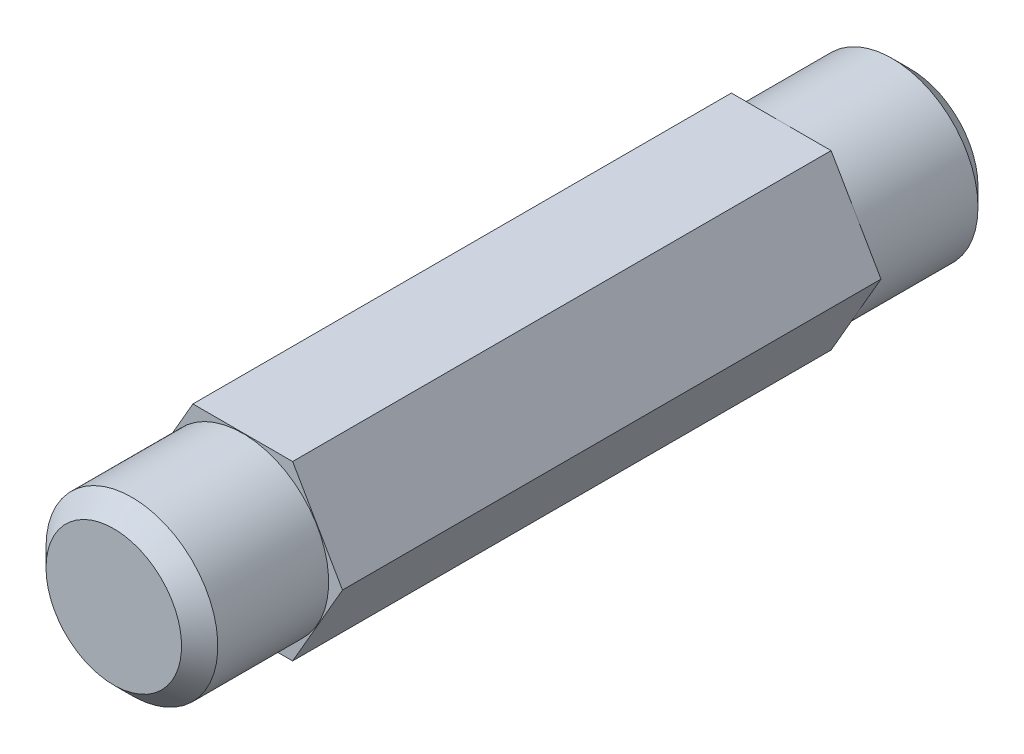
ISO-10303-21;
HEADER;
FILE_DESCRIPTION(('STEP AP214'),'2;1');
FILE_NAME('part.step','',(''),(''),'','','');
FILE_SCHEMA(('AUTOMOTIVE_DESIGN { 1 0 10303 214 1 1 1 1 }'));
ENDSEC;
DATA;
#1=APPLICATION_CONTEXT('core data for automotive mechanical design processes');
#2=APPLICATION_PROTOCOL_DEFINITION('international standard','automotive_design',2000,#1);
#3=PRODUCT_CONTEXT('',#1,'mechanical');
#4=PRODUCT('Part','Part','',(#3));
#5=PRODUCT_RELATED_PRODUCT_CATEGORY('part','',(#4));
#6=PRODUCT_DEFINITION_FORMATION('','',#4);
#7=PRODUCT_DEFINITION_CONTEXT('part definition',#1,'design');
#8=PRODUCT_DEFINITION('design','',#6,#7);
#9=PRODUCT_DEFINITION_SHAPE('','',#8);
#10=(LENGTH_UNIT() NAMED_UNIT(*) SI_UNIT(.MILLI.,.METRE.));
#11=(NAMED_UNIT(*) PLANE_ANGLE_UNIT() SI_UNIT($,.RADIAN.));
#12=(NAMED_UNIT(*) SI_UNIT($,.STERADIAN.) SOLID_ANGLE_UNIT());
#13=UNCERTAINTY_MEASURE_WITH_UNIT(LENGTH_MEASURE(1.E-05),#10,'distance_accuracy_value','');
#14=(GEOMETRIC_REPRESENTATION_CONTEXT(3) GLOBAL_UNCERTAINTY_ASSIGNED_CONTEXT((#13)) GLOBAL_UNIT_ASSIGNED_CONTEXT((#10,
#11,#12)) REPRESENTATION_CONTEXT('',''));
#15=CARTESIAN_POINT('',(0.,0.,0.));
#16=DIRECTION('',(0.,0.,1.));
#17=DIRECTION('',(1.,0.,0.));
#18=AXIS2_PLACEMENT_3D('',#15,#16,#17);
#19=CARTESIAN_POINT('',(0.,0.,21.9583));
#20=DIRECTION('',(0.,0.,1.));
#21=DIRECTION('',(1.,0.,0.));
#22=AXIS2_PLACEMENT_3D('',#19,#20,#21);
#23=PLANE('',#22);
#24=CARTESIAN_POINT('',(0.,0.,21.9582999999943));
#25=DIRECTION('',(0.,0.,-1.));
#26=DIRECTION('',(-1.,0.,0.));
#27=AXIS2_PLACEMENT_3D('',#24,#25,#26);
#28=CIRCLE('',#27,3.73710000002347);
#29=CARTESIAN_POINT('',(-3.73710000002347,0.,21.9582999999943));
#30=VERTEX_POINT('',#29);
#31=EDGE_CURVE('E20',#30,#30,#28,.T.);
#32=ORIENTED_EDGE('',*,*,#31,.F.);
#33=EDGE_LOOP('',(#32));
#34=FACE_BOUND('',#33,.T.);
#35=ADVANCED_FACE('F17',(#34),#23,.T.);
#36=CARTESIAN_POINT('',(0.,0.,-21.9583));
#37=DIRECTION('',(0.,0.,-1.));
#38=DIRECTION('',(-1.,0.,0.));
#39=AXIS2_PLACEMENT_3D('',#36,#37,#38);
#40=PLANE('',#39);
#41=CARTESIAN_POINT('',(0.,0.,-21.9583000000512));
#42=DIRECTION('',(0.,0.,1.));
#43=DIRECTION('',(1.,0.,0.));
#44=AXIS2_PLACEMENT_3D('',#41,#42,#43);
#45=CIRCLE('',#44,3.73709999996663);
#46=CARTESIAN_POINT('',(3.73709999996663,0.,-21.9583000000512));
#47=VERTEX_POINT('',#46);
#48=EDGE_CURVE('E106',#47,#47,#45,.T.);
#49=ORIENTED_EDGE('',*,*,#48,.F.);
#50=EDGE_LOOP('',(#49));
#51=FACE_BOUND('',#50,.T.);
#52=ADVANCED_FACE('F124',(#51),#40,.T.);
#53=CARTESIAN_POINT('',(0.,0.,20.9582999999043));
#54=DIRECTION('',(0.,0.,-1.));
#55=DIRECTION('',(-1.,0.,0.));
#56=AXIS2_PLACEMENT_3D('',#53,#54,#55);
#57=CONICAL_SURFACE('',#56,4.73710000011351,0.785398163397448);
#58=CARTESIAN_POINT('',(0.,0.,20.9583));
#59=DIRECTION('',(0.,0.,-1.));
#60=DIRECTION('',(-1.,0.,0.));
#61=AXIS2_PLACEMENT_3D('',#58,#59,#60);
#62=CIRCLE('',#61,4.7371);
#63=CARTESIAN_POINT('',(-4.7371,0.,20.9583));
#64=VERTEX_POINT('',#63);
#65=EDGE_CURVE('E103',#64,#64,#62,.T.);
#66=ORIENTED_EDGE('',*,*,#65,.F.);
#67=EDGE_LOOP('',(#66));
#68=FACE_BOUND('',#67,.T.);
#69=ORIENTED_EDGE('',*,*,#31,.T.);
#70=EDGE_LOOP('',(#69));
#71=FACE_BOUND('',#70,.T.);
#72=ADVANCED_FACE('F121',(#68,#71),#57,.T.);
#73=CARTESIAN_POINT('',(0.,0.,-20.958300000018));
#74=DIRECTION('',(0.,0.,1.));
#75=DIRECTION('',(1.,0.,0.));
#76=AXIS2_PLACEMENT_3D('',#73,#74,#75);
#77=CONICAL_SURFACE('',#76,4.73709999994298,0.785398163369027);
#78=CARTESIAN_POINT('',(0.,0.,-20.9583));
#79=DIRECTION('',(0.,0.,1.));
#80=DIRECTION('',(1.,0.,0.));
#81=AXIS2_PLACEMENT_3D('',#78,#79,#80);
#82=CIRCLE('',#81,4.7371);
#83=CARTESIAN_POINT('',(4.7371,0.,-20.9583));
#84=VERTEX_POINT('',#83);
#85=EDGE_CURVE('E100',#84,#84,#82,.T.);
#86=ORIENTED_EDGE('',*,*,#85,.F.);
#87=EDGE_LOOP('',(#86));
#88=FACE_BOUND('',#87,.T.);
#89=ORIENTED_EDGE('',*,*,#48,.T.);
#90=EDGE_LOOP('',(#89));
#91=FACE_BOUND('',#90,.T.);
#92=ADVANCED_FACE('F166',(#88,#91),#77,.T.);
#93=CARTESIAN_POINT('',(0.,0.,21.9583));
#94=DIRECTION('',(0.,0.,-1.));
#95=DIRECTION('',(-1.,0.,0.));
#96=AXIS2_PLACEMENT_3D('',#93,#94,#95);
#97=CYLINDRICAL_SURFACE('',#96,4.7371);
#98=CARTESIAN_POINT('',(0.,0.,14.8463));
#99=DIRECTION('',(0.,0.,-1.));
#100=DIRECTION('',(-1.,0.,0.));
#101=AXIS2_PLACEMENT_3D('',#98,#99,#100);
#102=CIRCLE('',#101,4.7371);
#103=CARTESIAN_POINT('',(-4.7371,0.,14.8463));
#104=VERTEX_POINT('',#103);
#105=EDGE_CURVE('E112',#104,#104,#102,.T.);
#106=ORIENTED_EDGE('',*,*,#105,.F.);
#107=EDGE_LOOP('',(#106));
#108=FACE_BOUND('',#107,.T.);
#109=ORIENTED_EDGE('',*,*,#65,.T.);
#110=EDGE_LOOP('',(#109));
#111=FACE_BOUND('',#110,.T.);
#112=ADVANCED_FACE('F162',(#108,#111),#97,.T.);
#113=CARTESIAN_POINT('',(0.,0.,-21.9583));
#114=DIRECTION('',(0.,0.,1.));
#115=DIRECTION('',(1.,0.,0.));
#116=AXIS2_PLACEMENT_3D('',#113,#114,#115);
#117=CYLINDRICAL_SURFACE('',#116,4.7371);
#118=CARTESIAN_POINT('',(0.,0.,-14.8463));
#119=DIRECTION('',(0.,0.,1.));
#120=DIRECTION('',(1.,0.,0.));
#121=AXIS2_PLACEMENT_3D('',#118,#119,#120);
#122=CIRCLE('',#121,4.7371);
#123=CARTESIAN_POINT('',(4.7371,0.,-14.8463));
#124=VERTEX_POINT('',#123);
#125=EDGE_CURVE('E107',#124,#124,#122,.F.);
#126=ORIENTED_EDGE('',*,*,#125,.T.);
#127=EDGE_LOOP('',(#126));
#128=FACE_BOUND('',#127,.T.);
#129=ORIENTED_EDGE('',*,*,#85,.T.);
#130=EDGE_LOOP('',(#129));
#131=FACE_BOUND('',#130,.T.);
#132=ADVANCED_FACE('F159',(#128,#131),#117,.T.);
#133=CARTESIAN_POINT('',(5.49926131403118,0.,14.8463));
#134=DIRECTION('',(-0.866025403784439,-0.5,0.));
#135=DIRECTION('',(0.5,-0.866025403784439,0.));
#136=AXIS2_PLACEMENT_3D('',#133,#134,#135);
#137=PLANE('',#136);
#138=DIRECTION('',(0.,0.,-1.));
#139=VECTOR('',#138,1.);
#140=CARTESIAN_POINT('',(2.74963065701559,4.7625,14.8463));
#141=LINE('',#140,#139);
#142=CARTESIAN_POINT('',(2.74963065701559,4.7625,-14.8463));
#143=VERTEX_POINT('',#142);
#144=CARTESIAN_POINT('',(2.74963065701559,4.7625,14.8463));
#145=VERTEX_POINT('',#144);
#146=EDGE_CURVE('E82',#143,#145,#141,.F.);
#147=ORIENTED_EDGE('',*,*,#146,.T.);
#148=DIRECTION('',(-0.5,0.866025403784439,0.));
#149=VECTOR('',#148,1.);
#150=CARTESIAN_POINT('',(5.49926131403118,0.,14.8463));
#151=LINE('',#150,#149);
#152=CARTESIAN_POINT('',(5.49926131403118,0.,14.8463));
#153=VERTEX_POINT('',#152);
#154=EDGE_CURVE('E87',#153,#145,#151,.T.);
#155=ORIENTED_EDGE('',*,*,#154,.F.);
#156=DIRECTION('',(0.,0.,1.));
#157=VECTOR('',#156,1.);
#158=CARTESIAN_POINT('',(5.49926131403118,0.,14.8463));
#159=LINE('',#158,#157);
#160=CARTESIAN_POINT('',(5.49926131403118,0.,-14.8463));
#161=VERTEX_POINT('',#160);
#162=EDGE_CURVE('E73',#153,#161,#159,.F.);
#163=ORIENTED_EDGE('',*,*,#162,.T.);
#164=DIRECTION('',(-0.5,0.866025403784439,0.));
#165=VECTOR('',#164,1.);
#166=CARTESIAN_POINT('',(5.49926131403118,0.,-14.8463));
#167=LINE('',#166,#165);
#168=EDGE_CURVE('E110',#161,#143,#167,.T.);
#169=ORIENTED_EDGE('',*,*,#168,.T.);
#170=EDGE_LOOP('',(#147,#155,#163,#169));
#171=FACE_BOUND('',#170,.T.);
#172=ADVANCED_FACE('F91',(#171),#137,.F.);
#173=CARTESIAN_POINT('',(-2.74963065701559,-4.7625,14.8463));
#174=DIRECTION('',(0.,1.,0.));
#175=DIRECTION('',(0.,0.,1.));
#176=AXIS2_PLACEMENT_3D('',#173,#174,#175);
#177=PLANE('',#176);
#178=DIRECTION('',(0.,0.,1.));
#179=VECTOR('',#178,1.);
#180=CARTESIAN_POINT('',(2.74963065701559,-4.7625,14.8463));
#181=LINE('',#180,#179);
#182=CARTESIAN_POINT('',(2.74963065701559,-4.7625,-14.8463));
#183=VERTEX_POINT('',#182);
#184=CARTESIAN_POINT('',(2.74963065701559,-4.7625,14.8463));
#185=VERTEX_POINT('',#184);
#186=EDGE_CURVE('E66',#183,#185,#181,.T.);
#187=ORIENTED_EDGE('',*,*,#186,.T.);
#188=DIRECTION('',(1.,0.,0.));
#189=VECTOR('',#188,1.);
#190=CARTESIAN_POINT('',(5.49926131403118,-4.7625,14.8463));
#191=LINE('',#190,#189);
#192=CARTESIAN_POINT('',(-2.74963065701559,-4.7625,14.8463));
#193=VERTEX_POINT('',#192);
#194=EDGE_CURVE('E89',#193,#185,#191,.T.);
#195=ORIENTED_EDGE('',*,*,#194,.F.);
#196=DIRECTION('',(0.,0.,1.));
#197=VECTOR('',#196,1.);
#198=CARTESIAN_POINT('',(-2.74963065701559,-4.7625,14.8463));
#199=LINE('',#198,#197);
#200=CARTESIAN_POINT('',(-2.74963065701559,-4.7625,-14.8463));
#201=VERTEX_POINT('',#200);
#202=EDGE_CURVE('E111',#193,#201,#199,.F.);
#203=ORIENTED_EDGE('',*,*,#202,.T.);
#204=DIRECTION('',(1.,0.,0.));
#205=VECTOR('',#204,1.);
#206=CARTESIAN_POINT('',(5.49926131403118,-4.7625,-14.8463));
#207=LINE('',#206,#205);
#208=EDGE_CURVE('E282',#201,#183,#207,.T.);
#209=ORIENTED_EDGE('',*,*,#208,.T.);
#210=EDGE_LOOP('',(#187,#195,#203,#209));
#211=FACE_BOUND('',#210,.T.);
#212=ADVANCED_FACE('F154',(#211),#177,.F.);
#213=CARTESIAN_POINT('',(2.74963065701559,-4.7625,14.8463));
#214=DIRECTION('',(-0.866025403784439,0.5,0.));
#215=DIRECTION('',(-0.5,-0.866025403784439,0.));
#216=AXIS2_PLACEMENT_3D('',#213,#214,#215);
#217=PLANE('',#216);
#218=ORIENTED_EDGE('',*,*,#162,.F.);
#219=DIRECTION('',(0.5,0.866025403784439,0.));
#220=VECTOR('',#219,1.);
#221=CARTESIAN_POINT('',(2.74963065701559,-4.7625,14.8463));
#222=LINE('',#221,#220);
#223=EDGE_CURVE('E76',#185,#153,#222,.T.);
#224=ORIENTED_EDGE('',*,*,#223,.F.);
#225=ORIENTED_EDGE('',*,*,#186,.F.);
#226=DIRECTION('',(0.5,0.866025403784439,0.));
#227=VECTOR('',#226,1.);
#228=CARTESIAN_POINT('',(2.74963065701559,-4.7625,-14.8463));
#229=LINE('',#228,#227);
#230=EDGE_CURVE('E78',#183,#161,#229,.T.);
#231=ORIENTED_EDGE('',*,*,#230,.T.);
#232=EDGE_LOOP('',(#218,#224,#225,#231));
#233=FACE_BOUND('',#232,.T.);
#234=ADVANCED_FACE('F75',(#233),#217,.F.);
#235=CARTESIAN_POINT('',(2.74963065701559,4.7625,14.8463));
#236=DIRECTION('',(0.,-1.,0.));
#237=DIRECTION('',(0.,0.,-1.));
#238=AXIS2_PLACEMENT_3D('',#235,#236,#237);
#239=PLANE('',#238);
#240=DIRECTION('',(0.,0.,1.));
#241=VECTOR('',#240,1.);
#242=CARTESIAN_POINT('',(-2.74963065701559,4.7625,14.8463));
#243=LINE('',#242,#241);
#244=CARTESIAN_POINT('',(-2.74963065701559,4.7625,-14.8463));
#245=VERTEX_POINT('',#244);
#246=CARTESIAN_POINT('',(-2.74963065701559,4.7625,14.8463));
#247=VERTEX_POINT('',#246);
#248=EDGE_CURVE('E274',#245,#247,#243,.T.);
#249=ORIENTED_EDGE('',*,*,#248,.T.);
#250=DIRECTION('',(1.,0.,0.));
#251=VECTOR('',#250,1.);
#252=CARTESIAN_POINT('',(5.49926131403118,4.7625,14.8463));
#253=LINE('',#252,#251);
#254=EDGE_CURVE('E93',#145,#247,#253,.F.);
#255=ORIENTED_EDGE('',*,*,#254,.F.);
#256=ORIENTED_EDGE('',*,*,#146,.F.);
#257=DIRECTION('',(1.,0.,0.));
#258=VECTOR('',#257,1.);
#259=CARTESIAN_POINT('',(5.49926131403118,4.7625,-14.8463));
#260=LINE('',#259,#258);
#261=EDGE_CURVE('E276',#143,#245,#260,.F.);
#262=ORIENTED_EDGE('',*,*,#261,.T.);
#263=EDGE_LOOP('',(#249,#255,#256,#262));
#264=FACE_BOUND('',#263,.T.);
#265=ADVANCED_FACE('F147',(#264),#239,.F.);
#266=CARTESIAN_POINT('',(5.49926131403118,0.,14.8463));
#267=DIRECTION('',(0.,0.,1.));
#268=DIRECTION('',(1.,0.,0.));
#269=AXIS2_PLACEMENT_3D('',#266,#267,#268);
#270=PLANE('',#269);
#271=ORIENTED_EDGE('',*,*,#105,.T.);
#272=EDGE_LOOP('',(#271));
#273=FACE_BOUND('',#272,.T.);
#274=DIRECTION('',(-0.5,0.866025403784439,0.));
#275=VECTOR('',#274,1.);
#276=CARTESIAN_POINT('',(-5.49926131403119,0.,14.8463));
#277=LINE('',#276,#275);
#278=CARTESIAN_POINT('',(-5.49926131403119,0.,14.8463));
#279=VERTEX_POINT('',#278);
#280=EDGE_CURVE('E114',#279,#193,#277,.F.);
#281=ORIENTED_EDGE('',*,*,#280,.T.);
#282=ORIENTED_EDGE('',*,*,#194,.T.);
#283=ORIENTED_EDGE('',*,*,#223,.T.);
#284=ORIENTED_EDGE('',*,*,#154,.T.);
#285=ORIENTED_EDGE('',*,*,#254,.T.);
#286=DIRECTION('',(0.5,0.866025403784439,0.));
#287=VECTOR('',#286,1.);
#288=CARTESIAN_POINT('',(-2.74963065701559,4.7625,14.8463));
#289=LINE('',#288,#287);
#290=EDGE_CURVE('E278',#247,#279,#289,.F.);
#291=ORIENTED_EDGE('',*,*,#290,.T.);
#292=EDGE_LOOP('',(#281,#282,#283,#284,#285,#291));
#293=FACE_BOUND('',#292,.T.);
#294=ADVANCED_FACE('F86',(#273,#293),#270,.T.);
#295=CARTESIAN_POINT('',(-5.49926131403119,0.,14.8463));
#296=DIRECTION('',(0.866025403784439,0.5,0.));
#297=DIRECTION('',(-0.5,0.866025403784439,0.));
#298=AXIS2_PLACEMENT_3D('',#295,#296,#297);
#299=PLANE('',#298);
#300=ORIENTED_EDGE('',*,*,#202,.F.);
#301=ORIENTED_EDGE('',*,*,#280,.F.);
#302=DIRECTION('',(0.,0.,1.));
#303=VECTOR('',#302,1.);
#304=CARTESIAN_POINT('',(-5.49926131403119,0.,14.8463));
#305=LINE('',#304,#303);
#306=CARTESIAN_POINT('',(-5.49926131403119,0.,-14.8463));
#307=VERTEX_POINT('',#306);
#308=EDGE_CURVE('E26',#279,#307,#305,.F.);
#309=ORIENTED_EDGE('',*,*,#308,.T.);
#310=DIRECTION('',(0.5,-0.866025403784439,0.));
#311=VECTOR('',#310,1.);
#312=CARTESIAN_POINT('',(-5.49926131403119,0.,-14.8463));
#313=LINE('',#312,#311);
#314=EDGE_CURVE('E34',#307,#201,#313,.T.);
#315=ORIENTED_EDGE('',*,*,#314,.T.);
#316=EDGE_LOOP('',(#300,#301,#309,#315));
#317=FACE_BOUND('',#316,.T.);
#318=ADVANCED_FACE('F138',(#317),#299,.F.);
#319=CARTESIAN_POINT('',(5.49926131403118,0.,-14.8463));
#320=DIRECTION('',(0.,0.,1.));
#321=DIRECTION('',(1.,0.,0.));
#322=AXIS2_PLACEMENT_3D('',#319,#320,#321);
#323=PLANE('',#322);
#324=ORIENTED_EDGE('',*,*,#208,.F.);
#325=ORIENTED_EDGE('',*,*,#314,.F.);
#326=DIRECTION('',(0.5,0.866025403784439,0.));
#327=VECTOR('',#326,1.);
#328=CARTESIAN_POINT('',(-2.74963065701559,4.7625,-14.8463));
#329=LINE('',#328,#327);
#330=EDGE_CURVE('E11',#307,#245,#329,.T.);
#331=ORIENTED_EDGE('',*,*,#330,.T.);
#332=ORIENTED_EDGE('',*,*,#261,.F.);
#333=ORIENTED_EDGE('',*,*,#168,.F.);
#334=ORIENTED_EDGE('',*,*,#230,.F.);
#335=EDGE_LOOP('',(#324,#325,#331,#332,#333,#334));
#336=FACE_BOUND('',#335,.T.);
#337=ORIENTED_EDGE('',*,*,#125,.F.);
#338=EDGE_LOOP('',(#337));
#339=FACE_BOUND('',#338,.T.);
#340=ADVANCED_FACE('F132',(#336,#339),#323,.F.);
#341=CARTESIAN_POINT('',(-2.74963065701559,4.7625,14.8463));
#342=DIRECTION('',(0.866025403784439,-0.5,0.));
#343=DIRECTION('',(0.5,0.866025403784439,0.));
#344=AXIS2_PLACEMENT_3D('',#341,#342,#343);
#345=PLANE('',#344);
#346=ORIENTED_EDGE('',*,*,#308,.F.);
#347=ORIENTED_EDGE('',*,*,#290,.F.);
#348=ORIENTED_EDGE('',*,*,#248,.F.);
#349=ORIENTED_EDGE('',*,*,#330,.F.);
#350=EDGE_LOOP('',(#346,#347,#348,#349));
#351=FACE_BOUND('',#350,.T.);
#352=ADVANCED_FACE('F130',(#351),#345,.F.);
#353=CLOSED_SHELL('',(#35,#52,#72,#92,#112,#132,#172,#212,#234,#265,#294,#318,#340,#352));
#354=MANIFOLD_SOLID_BREP('B1',#353);
#355=ADVANCED_BREP_SHAPE_REPRESENTATION('',(#18,#354),#14);
#356=SHAPE_DEFINITION_REPRESENTATION(#9,#355);
ENDSEC;
END-ISO-10303-21;
